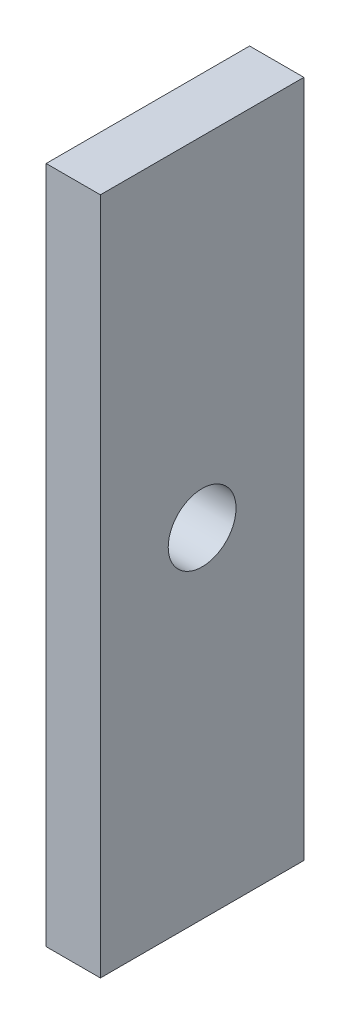
ISO-10303-21;
HEADER;
FILE_DESCRIPTION(('STEP AP214'),'2;1');
FILE_NAME('part.step','',(''),(''),'','','');
FILE_SCHEMA(('AUTOMOTIVE_DESIGN { 1 0 10303 214 1 1 1 1 }'));
ENDSEC;
DATA;
#1=APPLICATION_CONTEXT('core data for automotive mechanical design processes');
#2=APPLICATION_PROTOCOL_DEFINITION('international standard','automotive_design',2000,#1);
#3=PRODUCT_CONTEXT('',#1,'mechanical');
#4=PRODUCT('Part','Part','',(#3));
#5=PRODUCT_RELATED_PRODUCT_CATEGORY('part','',(#4));
#6=PRODUCT_DEFINITION_FORMATION('','',#4);
#7=PRODUCT_DEFINITION_CONTEXT('part definition',#1,'design');
#8=PRODUCT_DEFINITION('design','',#6,#7);
#9=PRODUCT_DEFINITION_SHAPE('','',#8);
#10=(LENGTH_UNIT() NAMED_UNIT(*) SI_UNIT(.MILLI.,.METRE.));
#11=(NAMED_UNIT(*) PLANE_ANGLE_UNIT() SI_UNIT($,.RADIAN.));
#12=(NAMED_UNIT(*) SI_UNIT($,.STERADIAN.) SOLID_ANGLE_UNIT());
#13=UNCERTAINTY_MEASURE_WITH_UNIT(LENGTH_MEASURE(1.E-05),#10,'distance_accuracy_value','');
#14=(GEOMETRIC_REPRESENTATION_CONTEXT(3) GLOBAL_UNCERTAINTY_ASSIGNED_CONTEXT((#13)) GLOBAL_UNIT_ASSIGNED_CONTEXT((#10,
#11,#12)) REPRESENTATION_CONTEXT('',''));
#15=CARTESIAN_POINT('',(0.,0.,0.));
#16=DIRECTION('',(0.,0.,1.));
#17=DIRECTION('',(1.,0.,0.));
#18=AXIS2_PLACEMENT_3D('',#15,#16,#17);
#19=CARTESIAN_POINT('',(57.,209.234447018793,533.378586774658));
#20=DIRECTION('',(0.,-1.,0.));
#21=DIRECTION('',(0.,0.,-1.));
#22=AXIS2_PLACEMENT_3D('',#19,#20,#21);
#23=PLANE('',#22);
#24=DIRECTION('',(0.,0.,-1.));
#25=VECTOR('',#24,1.);
#26=CARTESIAN_POINT('',(63.,209.234447018793,533.378586774658));
#27=LINE('',#26,#25);
#28=CARTESIAN_POINT('',(63.,209.234447018793,638.754219734892));
#29=VERTEX_POINT('',#28);
#30=CARTESIAN_POINT('',(63.,209.234447018793,616.254219734891));
#31=VERTEX_POINT('',#30);
#32=EDGE_CURVE('E87',#29,#31,#27,.T.);
#33=ORIENTED_EDGE('',*,*,#32,.F.);
#34=DIRECTION('',(1.,0.,0.));
#35=VECTOR('',#34,1.);
#36=CARTESIAN_POINT('',(57.,209.234447018793,638.754219734892));
#37=LINE('',#36,#35);
#38=CARTESIAN_POINT('',(57.,209.234447018793,638.754219734892));
#39=VERTEX_POINT('',#38);
#40=EDGE_CURVE('E42',#39,#29,#37,.T.);
#41=ORIENTED_EDGE('',*,*,#40,.F.);
#42=DIRECTION('',(0.,0.,-1.));
#43=VECTOR('',#42,1.);
#44=CARTESIAN_POINT('',(57.,209.234447018793,533.378586774658));
#45=LINE('',#44,#43);
#46=CARTESIAN_POINT('',(57.,209.234447018793,616.254219734891));
#47=VERTEX_POINT('',#46);
#48=EDGE_CURVE('E94',#39,#47,#45,.T.);
#49=ORIENTED_EDGE('',*,*,#48,.T.);
#50=DIRECTION('',(1.,0.,0.));
#51=VECTOR('',#50,1.);
#52=CARTESIAN_POINT('',(57.,209.234447018793,616.254219734891));
#53=LINE('',#52,#51);
#54=EDGE_CURVE('E11',#47,#31,#53,.T.);
#55=ORIENTED_EDGE('',*,*,#54,.T.);
#56=EDGE_LOOP('',(#33,#41,#49,#55));
#57=FACE_BOUND('',#56,.T.);
#58=ADVANCED_FACE('F34',(#57),#23,.T.);
#59=CARTESIAN_POINT('',(57.,209.724279965974,638.754219734892));
#60=DIRECTION('',(0.,0.,1.));
#61=DIRECTION('',(0.,-1.,0.));
#62=AXIS2_PLACEMENT_3D('',#59,#60,#61);
#63=PLANE('',#62);
#64=DIRECTION('',(0.,-1.,0.));
#65=VECTOR('',#64,1.);
#66=CARTESIAN_POINT('',(63.,209.724279965974,638.754219734892));
#67=LINE('',#66,#65);
#68=CARTESIAN_POINT('',(63.,284.234447018793,638.754219734892));
#69=VERTEX_POINT('',#68);
#70=EDGE_CURVE('E91',#69,#29,#67,.T.);
#71=ORIENTED_EDGE('',*,*,#70,.F.);
#72=DIRECTION('',(1.,0.,0.));
#73=VECTOR('',#72,1.);
#74=CARTESIAN_POINT('',(57.,284.234447018793,638.754219734892));
#75=LINE('',#74,#73);
#76=CARTESIAN_POINT('',(57.,284.234447018793,638.754219734892));
#77=VERTEX_POINT('',#76);
#78=EDGE_CURVE('E50',#77,#69,#75,.T.);
#79=ORIENTED_EDGE('',*,*,#78,.F.);
#80=DIRECTION('',(0.,-1.,0.));
#81=VECTOR('',#80,1.);
#82=CARTESIAN_POINT('',(57.,209.724279965974,638.754219734892));
#83=LINE('',#82,#81);
#84=EDGE_CURVE('E101',#77,#39,#83,.T.);
#85=ORIENTED_EDGE('',*,*,#84,.T.);
#86=ORIENTED_EDGE('',*,*,#40,.T.);
#87=EDGE_LOOP('',(#71,#79,#85,#86));
#88=FACE_BOUND('',#87,.T.);
#89=ADVANCED_FACE('F99',(#88),#63,.T.);
#90=CARTESIAN_POINT('',(57.,284.234447018793,533.378586774658));
#91=DIRECTION('',(0.,-1.,0.));
#92=DIRECTION('',(0.,0.,-1.));
#93=AXIS2_PLACEMENT_3D('',#90,#91,#92);
#94=PLANE('',#93);
#95=DIRECTION('',(0.,0.,-1.));
#96=VECTOR('',#95,1.);
#97=CARTESIAN_POINT('',(63.,284.234447018793,533.378586774658));
#98=LINE('',#97,#96);
#99=CARTESIAN_POINT('',(63.,284.234447018793,616.254219734891));
#100=VERTEX_POINT('',#99);
#101=EDGE_CURVE('E85',#69,#100,#98,.T.);
#102=ORIENTED_EDGE('',*,*,#101,.T.);
#103=DIRECTION('',(1.,0.,0.));
#104=VECTOR('',#103,1.);
#105=CARTESIAN_POINT('',(57.,284.234447018793,616.254219734891));
#106=LINE('',#105,#104);
#107=CARTESIAN_POINT('',(57.,284.234447018793,616.254219734891));
#108=VERTEX_POINT('',#107);
#109=EDGE_CURVE('E68',#108,#100,#106,.T.);
#110=ORIENTED_EDGE('',*,*,#109,.F.);
#111=DIRECTION('',(0.,0.,-1.));
#112=VECTOR('',#111,1.);
#113=CARTESIAN_POINT('',(57.,284.234447018793,533.378586774658));
#114=LINE('',#113,#112);
#115=EDGE_CURVE('E109',#77,#108,#114,.T.);
#116=ORIENTED_EDGE('',*,*,#115,.F.);
#117=ORIENTED_EDGE('',*,*,#78,.T.);
#118=EDGE_LOOP('',(#102,#110,#116,#117));
#119=FACE_BOUND('',#118,.T.);
#120=ADVANCED_FACE('F89',(#119),#94,.F.);
#121=CARTESIAN_POINT('',(57.,246.734447018793,627.504219734892));
#122=DIRECTION('',(1.,0.,0.));
#123=DIRECTION('',(0.,0.,-1.));
#124=AXIS2_PLACEMENT_3D('',#121,#122,#123);
#125=CYLINDRICAL_SURFACE('',#124,3.75);
#126=CARTESIAN_POINT('',(57.,246.734447018793,627.504219734892));
#127=DIRECTION('',(-1.,0.,0.));
#128=DIRECTION('',(0.,0.,1.));
#129=AXIS2_PLACEMENT_3D('',#126,#127,#128);
#130=CIRCLE('',#129,3.75);
#131=CARTESIAN_POINT('',(57.,246.734447018793,631.254219734892));
#132=VERTEX_POINT('',#131);
#133=EDGE_CURVE('E78',#132,#132,#130,.F.);
#134=ORIENTED_EDGE('',*,*,#133,.F.);
#135=EDGE_LOOP('',(#134));
#136=FACE_BOUND('',#135,.T.);
#137=CARTESIAN_POINT('',(63.,246.734447018793,627.504219734892));
#138=DIRECTION('',(-1.,0.,0.));
#139=DIRECTION('',(0.,0.,1.));
#140=AXIS2_PLACEMENT_3D('',#137,#138,#139);
#141=CIRCLE('',#140,3.75);
#142=CARTESIAN_POINT('',(63.,246.734447018793,631.254219734892));
#143=VERTEX_POINT('',#142);
#144=EDGE_CURVE('E90',#143,#143,#141,.F.);
#145=ORIENTED_EDGE('',*,*,#144,.T.);
#146=EDGE_LOOP('',(#145));
#147=FACE_BOUND('',#146,.T.);
#148=ADVANCED_FACE('F118',(#136,#147),#125,.F.);
#149=CARTESIAN_POINT('',(57.,209.724279965974,533.378586774658));
#150=DIRECTION('',(-1.,0.,0.));
#151=DIRECTION('',(0.,0.,1.));
#152=AXIS2_PLACEMENT_3D('',#149,#150,#151);
#153=PLANE('',#152);
#154=DIRECTION('',(0.,1.,0.));
#155=VECTOR('',#154,1.);
#156=CARTESIAN_POINT('',(57.,209.724279965974,616.254219734891));
#157=LINE('',#156,#155);
#158=EDGE_CURVE('E76',#47,#108,#157,.T.);
#159=ORIENTED_EDGE('',*,*,#158,.F.);
#160=ORIENTED_EDGE('',*,*,#48,.F.);
#161=ORIENTED_EDGE('',*,*,#84,.F.);
#162=ORIENTED_EDGE('',*,*,#115,.T.);
#163=EDGE_LOOP('',(#159,#160,#161,#162));
#164=FACE_BOUND('',#163,.T.);
#165=ORIENTED_EDGE('',*,*,#133,.T.);
#166=EDGE_LOOP('',(#165));
#167=FACE_BOUND('',#166,.T.);
#168=ADVANCED_FACE('F113',(#164,#167),#153,.T.);
#169=CARTESIAN_POINT('',(63.,209.724279965974,533.378586774658));
#170=DIRECTION('',(-1.,0.,0.));
#171=DIRECTION('',(0.,0.,1.));
#172=AXIS2_PLACEMENT_3D('',#169,#170,#171);
#173=PLANE('',#172);
#174=ORIENTED_EDGE('',*,*,#32,.T.);
#175=DIRECTION('',(0.,-1.,0.));
#176=VECTOR('',#175,1.);
#177=CARTESIAN_POINT('',(63.,284.234447018793,616.254219734891));
#178=LINE('',#177,#176);
#179=EDGE_CURVE('E73',#100,#31,#178,.T.);
#180=ORIENTED_EDGE('',*,*,#179,.F.);
#181=ORIENTED_EDGE('',*,*,#101,.F.);
#182=ORIENTED_EDGE('',*,*,#70,.T.);
#183=EDGE_LOOP('',(#174,#180,#181,#182));
#184=FACE_BOUND('',#183,.T.);
#185=ORIENTED_EDGE('',*,*,#144,.F.);
#186=EDGE_LOOP('',(#185));
#187=FACE_BOUND('',#186,.T.);
#188=ADVANCED_FACE('F82',(#184,#187),#173,.F.);
#189=CARTESIAN_POINT('',(7.64999999999998,284.234447018793,616.254219734891));
#190=DIRECTION('',(0.,0.,1.));
#191=DIRECTION('',(1.,0.,0.));
#192=AXIS2_PLACEMENT_3D('',#189,#190,#191);
#193=PLANE('',#192);
#194=ORIENTED_EDGE('',*,*,#54,.F.);
#195=ORIENTED_EDGE('',*,*,#158,.T.);
#196=ORIENTED_EDGE('',*,*,#109,.T.);
#197=ORIENTED_EDGE('',*,*,#179,.T.);
#198=EDGE_LOOP('',(#194,#195,#196,#197));
#199=FACE_BOUND('',#198,.T.);
#200=ADVANCED_FACE('F71',(#199),#193,.F.);
#201=CLOSED_SHELL('',(#58,#89,#120,#148,#168,#188,#200));
#202=MANIFOLD_SOLID_BREP('B2',#201);
#203=ADVANCED_BREP_SHAPE_REPRESENTATION('',(#18,#202),#14);
#204=SHAPE_DEFINITION_REPRESENTATION(#9,#203);
ENDSEC;
END-ISO-10303-21;
